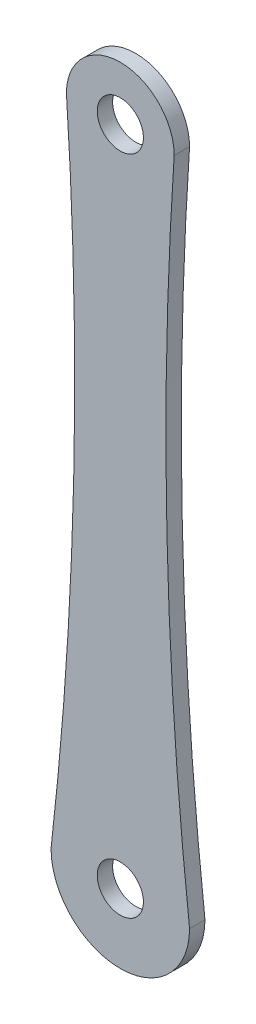
ISO-10303-21;
HEADER;
FILE_DESCRIPTION(('STEP AP214'),'2;1');
FILE_NAME('part.step','',(''),(''),'','','');
FILE_SCHEMA(('AUTOMOTIVE_DESIGN { 1 0 10303 214 1 1 1 1 }'));
ENDSEC;
DATA;
#1=APPLICATION_CONTEXT('core data for automotive mechanical design processes');
#2=APPLICATION_PROTOCOL_DEFINITION('international standard','automotive_design',2000,#1);
#3=PRODUCT_CONTEXT('',#1,'mechanical');
#4=PRODUCT('Part','Part','',(#3));
#5=PRODUCT_RELATED_PRODUCT_CATEGORY('part','',(#4));
#6=PRODUCT_DEFINITION_FORMATION('','',#4);
#7=PRODUCT_DEFINITION_CONTEXT('part definition',#1,'design');
#8=PRODUCT_DEFINITION('design','',#6,#7);
#9=PRODUCT_DEFINITION_SHAPE('','',#8);
#10=(LENGTH_UNIT() NAMED_UNIT(*) SI_UNIT(.MILLI.,.METRE.));
#11=(NAMED_UNIT(*) PLANE_ANGLE_UNIT() SI_UNIT($,.RADIAN.));
#12=(NAMED_UNIT(*) SI_UNIT($,.STERADIAN.) SOLID_ANGLE_UNIT());
#13=UNCERTAINTY_MEASURE_WITH_UNIT(LENGTH_MEASURE(1.E-05),#10,'distance_accuracy_value','');
#14=(GEOMETRIC_REPRESENTATION_CONTEXT(3) GLOBAL_UNCERTAINTY_ASSIGNED_CONTEXT((#13)) GLOBAL_UNIT_ASSIGNED_CONTEXT((#10,
#11,#12)) REPRESENTATION_CONTEXT('',''));
#15=CARTESIAN_POINT('',(0.,0.,0.));
#16=DIRECTION('',(0.,0.,1.));
#17=DIRECTION('',(1.,0.,0.));
#18=AXIS2_PLACEMENT_3D('',#15,#16,#17);
#19=CARTESIAN_POINT('',(845.48758539295,-18.6582063444965,4.));
#20=DIRECTION('',(0.,0.,1.));
#21=DIRECTION('',(1.,0.,0.));
#22=AXIS2_PLACEMENT_3D('',#19,#20,#21);
#23=PLANE('',#22);
#24=CARTESIAN_POINT('',(1.96948044486213E-13,187.75487306497,4.));
#25=DIRECTION('',(0.,0.,1.));
#26=DIRECTION('',(1.,0.,0.));
#27=AXIS2_PLACEMENT_3D('',#24,#25,#26);
#28=CIRCLE('',#27,10.5);
#29=CARTESIAN_POINT('',(10.5000000000002,187.75487306497,4.));
#30=VERTEX_POINT('',#29);
#31=EDGE_CURVE('E111',#30,#30,#28,.T.);
#32=ORIENTED_EDGE('',*,*,#31,.F.);
#33=EDGE_LOOP('',(#32));
#34=FACE_BOUND('',#33,.T.);
#35=CARTESIAN_POINT('',(1690.9751707859,75.9287142460371,4.));
#36=DIRECTION('',(0.,0.,-1.));
#37=DIRECTION('',(1.,0.,0.));
#38=AXIS2_PLACEMENT_3D('',#35,#36,#37);
#39=CIRCLE('',#38,1670.22291465603);
#40=CARTESIAN_POINT('',(31.5000000000002,-113.24512693503,4.));
#41=VERTEX_POINT('',#40);
#42=CARTESIAN_POINT('',(24.5000000000002,187.75487306497,4.));
#43=VERTEX_POINT('',#42);
#44=EDGE_CURVE('E91',#41,#43,#39,.T.);
#45=ORIENTED_EDGE('',*,*,#44,.T.);
#46=CARTESIAN_POINT('',(1.96948044486213E-13,187.75487306497,4.));
#47=DIRECTION('',(0.,0.,1.));
#48=DIRECTION('',(1.,0.,0.));
#49=AXIS2_PLACEMENT_3D('',#46,#47,#48);
#50=CIRCLE('',#49,24.5);
#51=CARTESIAN_POINT('',(-24.4999999999998,187.75487306497,4.));
#52=VERTEX_POINT('',#51);
#53=EDGE_CURVE('E86',#43,#52,#50,.T.);
#54=ORIENTED_EDGE('',*,*,#53,.T.);
#55=CARTESIAN_POINT('',(-1690.9751707859,75.9287142460371,4.));
#56=DIRECTION('',(0.,0.,-1.));
#57=DIRECTION('',(-1.,0.,0.));
#58=AXIS2_PLACEMENT_3D('',#55,#56,#57);
#59=CIRCLE('',#58,1670.22291465603);
#60=CARTESIAN_POINT('',(-31.4999999999998,-113.24512693503,4.));
#61=VERTEX_POINT('',#60);
#62=EDGE_CURVE('E89',#52,#61,#59,.T.);
#63=ORIENTED_EDGE('',*,*,#62,.T.);
#64=CARTESIAN_POINT('',(1.96948044486213E-13,-113.24512693503,4.));
#65=DIRECTION('',(0.,0.,1.));
#66=DIRECTION('',(1.,0.,0.));
#67=AXIS2_PLACEMENT_3D('',#64,#65,#66);
#68=CIRCLE('',#67,31.5);
#69=EDGE_CURVE('E56',#61,#41,#68,.T.);
#70=ORIENTED_EDGE('',*,*,#69,.T.);
#71=EDGE_LOOP('',(#45,#54,#63,#70));
#72=FACE_BOUND('',#71,.T.);
#73=CARTESIAN_POINT('',(1.96948044486213E-13,-113.24512693503,4.));
#74=DIRECTION('',(0.,0.,1.));
#75=DIRECTION('',(1.,0.,0.));
#76=AXIS2_PLACEMENT_3D('',#73,#74,#75);
#77=CIRCLE('',#76,10.5);
#78=CARTESIAN_POINT('',(10.5000000000002,-113.24512693503,4.));
#79=VERTEX_POINT('',#78);
#80=EDGE_CURVE('E133',#79,#79,#77,.T.);
#81=ORIENTED_EDGE('',*,*,#80,.F.);
#82=EDGE_LOOP('',(#81));
#83=FACE_BOUND('',#82,.T.);
#84=ADVANCED_FACE('F38',(#34,#72,#83),#23,.T.);
#85=CARTESIAN_POINT('',(845.48758539295,-18.6582063444965,-3.));
#86=DIRECTION('',(0.,0.,1.));
#87=DIRECTION('',(1.,0.,0.));
#88=AXIS2_PLACEMENT_3D('',#85,#86,#87);
#89=PLANE('',#88);
#90=CARTESIAN_POINT('',(1690.9751707859,75.9287142460371,-3.));
#91=DIRECTION('',(0.,0.,-1.));
#92=DIRECTION('',(1.,0.,0.));
#93=AXIS2_PLACEMENT_3D('',#90,#91,#92);
#94=CIRCLE('',#93,1670.22291465603);
#95=CARTESIAN_POINT('',(31.5000000000002,-113.24512693503,-3.));
#96=VERTEX_POINT('',#95);
#97=CARTESIAN_POINT('',(24.5000000000002,187.75487306497,-3.));
#98=VERTEX_POINT('',#97);
#99=EDGE_CURVE('E107',#96,#98,#94,.T.);
#100=ORIENTED_EDGE('',*,*,#99,.F.);
#101=CARTESIAN_POINT('',(1.96948044486213E-13,-113.24512693503,-3.));
#102=DIRECTION('',(0.,0.,1.));
#103=DIRECTION('',(1.,0.,0.));
#104=AXIS2_PLACEMENT_3D('',#101,#102,#103);
#105=CIRCLE('',#104,31.5);
#106=CARTESIAN_POINT('',(-31.4999999999998,-113.24512693503,-3.));
#107=VERTEX_POINT('',#106);
#108=EDGE_CURVE('E79',#107,#96,#105,.T.);
#109=ORIENTED_EDGE('',*,*,#108,.F.);
#110=CARTESIAN_POINT('',(-1690.9751707859,75.9287142460371,-3.));
#111=DIRECTION('',(0.,0.,-1.));
#112=DIRECTION('',(-1.,0.,0.));
#113=AXIS2_PLACEMENT_3D('',#110,#111,#112);
#114=CIRCLE('',#113,1670.22291465603);
#115=CARTESIAN_POINT('',(-24.4999999999998,187.75487306497,-3.));
#116=VERTEX_POINT('',#115);
#117=EDGE_CURVE('E73',#116,#107,#114,.T.);
#118=ORIENTED_EDGE('',*,*,#117,.F.);
#119=CARTESIAN_POINT('',(1.96948044486213E-13,187.75487306497,-3.));
#120=DIRECTION('',(0.,0.,1.));
#121=DIRECTION('',(1.,0.,0.));
#122=AXIS2_PLACEMENT_3D('',#119,#120,#121);
#123=CIRCLE('',#122,24.5);
#124=EDGE_CURVE('E96',#98,#116,#123,.T.);
#125=ORIENTED_EDGE('',*,*,#124,.F.);
#126=EDGE_LOOP('',(#100,#109,#118,#125));
#127=FACE_BOUND('',#126,.T.);
#128=CARTESIAN_POINT('',(1.96948044486213E-13,187.75487306497,-3.));
#129=DIRECTION('',(0.,0.,1.));
#130=DIRECTION('',(1.,0.,0.));
#131=AXIS2_PLACEMENT_3D('',#128,#129,#130);
#132=CIRCLE('',#131,10.5);
#133=CARTESIAN_POINT('',(10.5000000000002,187.75487306497,-3.));
#134=VERTEX_POINT('',#133);
#135=EDGE_CURVE('E129',#134,#134,#132,.T.);
#136=ORIENTED_EDGE('',*,*,#135,.T.);
#137=EDGE_LOOP('',(#136));
#138=FACE_BOUND('',#137,.T.);
#139=CARTESIAN_POINT('',(1.96948044486213E-13,-113.24512693503,-3.));
#140=DIRECTION('',(0.,0.,1.));
#141=DIRECTION('',(1.,0.,0.));
#142=AXIS2_PLACEMENT_3D('',#139,#140,#141);
#143=CIRCLE('',#142,10.5);
#144=CARTESIAN_POINT('',(10.5000000000002,-113.24512693503,-3.));
#145=VERTEX_POINT('',#144);
#146=EDGE_CURVE('E137',#145,#145,#143,.T.);
#147=ORIENTED_EDGE('',*,*,#146,.T.);
#148=EDGE_LOOP('',(#147));
#149=FACE_BOUND('',#148,.T.);
#150=ADVANCED_FACE('F124',(#127,#138,#149),#89,.F.);
#151=CARTESIAN_POINT('',(1690.9751707859,75.9287142460371,4.));
#152=DIRECTION('',(0.,0.,-1.));
#153=DIRECTION('',(-1.,0.,0.));
#154=AXIS2_PLACEMENT_3D('',#151,#152,#153);
#155=CYLINDRICAL_SURFACE('',#154,1670.22291465603);
#156=ORIENTED_EDGE('',*,*,#99,.T.);
#157=DIRECTION('',(0.,0.,-1.));
#158=VECTOR('',#157,1.);
#159=CARTESIAN_POINT('',(24.5000000000002,187.75487306497,4.));
#160=LINE('',#159,#158);
#161=EDGE_CURVE('E11',#43,#98,#160,.T.);
#162=ORIENTED_EDGE('',*,*,#161,.F.);
#163=ORIENTED_EDGE('',*,*,#44,.F.);
#164=DIRECTION('',(0.,0.,-1.));
#165=VECTOR('',#164,1.);
#166=CARTESIAN_POINT('',(31.5000000000002,-113.24512693503,4.));
#167=LINE('',#166,#165);
#168=EDGE_CURVE('E103',#41,#96,#167,.T.);
#169=ORIENTED_EDGE('',*,*,#168,.T.);
#170=EDGE_LOOP('',(#156,#162,#163,#169));
#171=FACE_BOUND('',#170,.T.);
#172=ADVANCED_FACE('F40',(#171),#155,.F.);
#173=CARTESIAN_POINT('',(1.96948044486213E-13,187.75487306497,4.));
#174=DIRECTION('',(0.,0.,-1.));
#175=DIRECTION('',(-1.,0.,0.));
#176=AXIS2_PLACEMENT_3D('',#173,#174,#175);
#177=CYLINDRICAL_SURFACE('',#176,24.5);
#178=ORIENTED_EDGE('',*,*,#124,.T.);
#179=DIRECTION('',(0.,0.,-1.));
#180=VECTOR('',#179,1.);
#181=CARTESIAN_POINT('',(-24.4999999999998,187.75487306497,4.));
#182=LINE('',#181,#180);
#183=EDGE_CURVE('E48',#52,#116,#182,.T.);
#184=ORIENTED_EDGE('',*,*,#183,.F.);
#185=ORIENTED_EDGE('',*,*,#53,.F.);
#186=ORIENTED_EDGE('',*,*,#161,.T.);
#187=EDGE_LOOP('',(#178,#184,#185,#186));
#188=FACE_BOUND('',#187,.T.);
#189=ADVANCED_FACE('F95',(#188),#177,.T.);
#190=CARTESIAN_POINT('',(-1690.9751707859,75.9287142460371,4.));
#191=DIRECTION('',(0.,0.,-1.));
#192=DIRECTION('',(-1.,0.,0.));
#193=AXIS2_PLACEMENT_3D('',#190,#191,#192);
#194=CYLINDRICAL_SURFACE('',#193,1670.22291465603);
#195=ORIENTED_EDGE('',*,*,#117,.T.);
#196=DIRECTION('',(0.,0.,-1.));
#197=VECTOR('',#196,1.);
#198=CARTESIAN_POINT('',(-31.4999999999998,-113.24512693503,4.));
#199=LINE('',#198,#197);
#200=EDGE_CURVE('E98',#61,#107,#199,.T.);
#201=ORIENTED_EDGE('',*,*,#200,.F.);
#202=ORIENTED_EDGE('',*,*,#62,.F.);
#203=ORIENTED_EDGE('',*,*,#183,.T.);
#204=EDGE_LOOP('',(#195,#201,#202,#203));
#205=FACE_BOUND('',#204,.T.);
#206=ADVANCED_FACE('F99',(#205),#194,.F.);
#207=CARTESIAN_POINT('',(1.96948044486213E-13,-113.24512693503,4.));
#208=DIRECTION('',(0.,0.,-1.));
#209=DIRECTION('',(-1.,0.,0.));
#210=AXIS2_PLACEMENT_3D('',#207,#208,#209);
#211=CYLINDRICAL_SURFACE('',#210,31.5);
#212=ORIENTED_EDGE('',*,*,#108,.T.);
#213=ORIENTED_EDGE('',*,*,#168,.F.);
#214=ORIENTED_EDGE('',*,*,#69,.F.);
#215=ORIENTED_EDGE('',*,*,#200,.T.);
#216=EDGE_LOOP('',(#212,#213,#214,#215));
#217=FACE_BOUND('',#216,.T.);
#218=ADVANCED_FACE('F121',(#217),#211,.T.);
#219=CARTESIAN_POINT('',(1.96948044486213E-13,187.75487306497,4.));
#220=DIRECTION('',(0.,0.,-1.));
#221=DIRECTION('',(-1.,0.,0.));
#222=AXIS2_PLACEMENT_3D('',#219,#220,#221);
#223=CYLINDRICAL_SURFACE('',#222,10.5);
#224=ORIENTED_EDGE('',*,*,#31,.T.);
#225=EDGE_LOOP('',(#224));
#226=FACE_BOUND('',#225,.T.);
#227=ORIENTED_EDGE('',*,*,#135,.F.);
#228=EDGE_LOOP('',(#227));
#229=FACE_BOUND('',#228,.T.);
#230=ADVANCED_FACE('F156',(#226,#229),#223,.F.);
#231=CARTESIAN_POINT('',(1.96948044486213E-13,-113.24512693503,4.));
#232=DIRECTION('',(0.,0.,-1.));
#233=DIRECTION('',(-1.,0.,0.));
#234=AXIS2_PLACEMENT_3D('',#231,#232,#233);
#235=CYLINDRICAL_SURFACE('',#234,10.5);
#236=ORIENTED_EDGE('',*,*,#80,.T.);
#237=EDGE_LOOP('',(#236));
#238=FACE_BOUND('',#237,.T.);
#239=ORIENTED_EDGE('',*,*,#146,.F.);
#240=EDGE_LOOP('',(#239));
#241=FACE_BOUND('',#240,.T.);
#242=ADVANCED_FACE('F145',(#238,#241),#235,.F.);
#243=CLOSED_SHELL('',(#84,#150,#172,#189,#206,#218,#230,#242));
#244=MANIFOLD_SOLID_BREP('B2',#243);
#245=ADVANCED_BREP_SHAPE_REPRESENTATION('',(#18,#244),#14);
#246=SHAPE_DEFINITION_REPRESENTATION(#9,#245);
ENDSEC;
END-ISO-10303-21;
